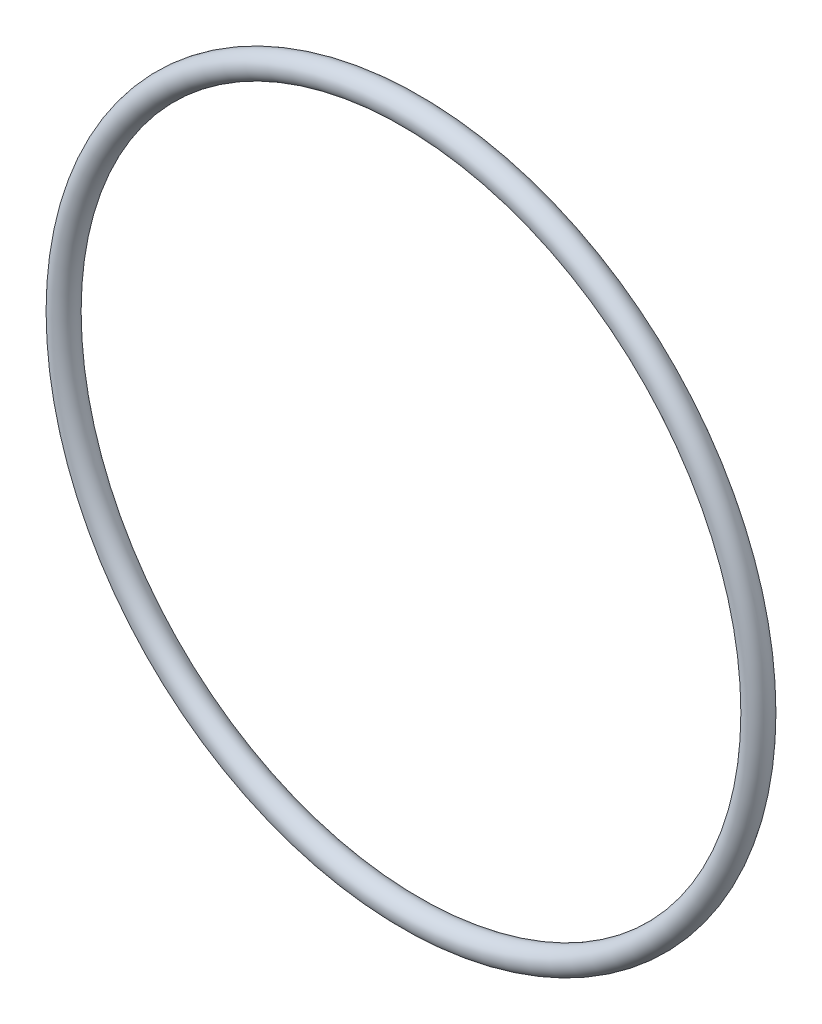
ISO-10303-21;
HEADER;
FILE_DESCRIPTION(('STEP AP214'),'2;1');
FILE_NAME('part.step','',(''),(''),'','','');
FILE_SCHEMA(('AUTOMOTIVE_DESIGN { 1 0 10303 214 1 1 1 1 }'));
ENDSEC;
DATA;
#1=APPLICATION_CONTEXT('core data for automotive mechanical design processes');
#2=APPLICATION_PROTOCOL_DEFINITION('international standard','automotive_design',2000,#1);
#3=PRODUCT_CONTEXT('',#1,'mechanical');
#4=PRODUCT('Part','Part','',(#3));
#5=PRODUCT_RELATED_PRODUCT_CATEGORY('part','',(#4));
#6=PRODUCT_DEFINITION_FORMATION('','',#4);
#7=PRODUCT_DEFINITION_CONTEXT('part definition',#1,'design');
#8=PRODUCT_DEFINITION('design','',#6,#7);
#9=PRODUCT_DEFINITION_SHAPE('','',#8);
#10=(LENGTH_UNIT() NAMED_UNIT(*) SI_UNIT(.MILLI.,.METRE.));
#11=(NAMED_UNIT(*) PLANE_ANGLE_UNIT() SI_UNIT($,.RADIAN.));
#12=(NAMED_UNIT(*) SI_UNIT($,.STERADIAN.) SOLID_ANGLE_UNIT());
#13=UNCERTAINTY_MEASURE_WITH_UNIT(LENGTH_MEASURE(1.E-05),#10,'distance_accuracy_value','');
#14=(GEOMETRIC_REPRESENTATION_CONTEXT(3) GLOBAL_UNCERTAINTY_ASSIGNED_CONTEXT((#13)) GLOBAL_UNIT_ASSIGNED_CONTEXT((#10,
#11,#12)) REPRESENTATION_CONTEXT('',''));
#15=CARTESIAN_POINT('',(0.,0.,0.));
#16=DIRECTION('',(0.,0.,1.));
#17=DIRECTION('',(1.,0.,0.));
#18=AXIS2_PLACEMENT_3D('',#15,#16,#17);
#19=CARTESIAN_POINT('',(0.,0.,1.7));
#20=DIRECTION('',(0.,0.,-1.));
#21=DIRECTION('',(-1.,0.,0.));
#22=AXIS2_PLACEMENT_3D('',#19,#20,#21);
#23=TOROIDAL_SURFACE('',#22,1.4,0.0499999999999999);
#24=CARTESIAN_POINT('',(-1.45,0.,1.7));
#25=VERTEX_POINT('',#24);
#26=VERTEX_LOOP('',#25);
#27=FACE_BOUND('',#26,.T.);
#28=ADVANCED_FACE('F13',(#27),#23,.T.);
#29=CLOSED_SHELL('',(#28));
#30=MANIFOLD_SOLID_BREP('B1',#29);
#31=ADVANCED_BREP_SHAPE_REPRESENTATION('',(#18,#30),#14);
#32=SHAPE_DEFINITION_REPRESENTATION(#9,#31);
ENDSEC;
END-ISO-10303-21;
